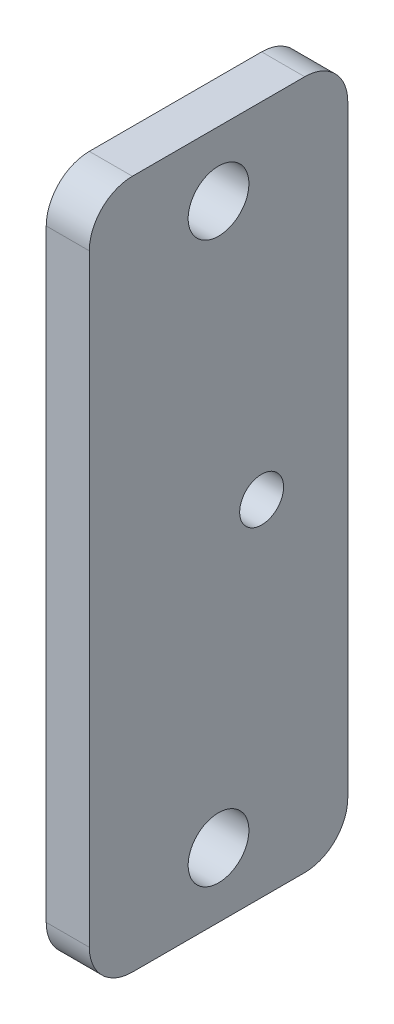
ISO-10303-21;
HEADER;
FILE_DESCRIPTION(('STEP AP214'),'2;1');
FILE_NAME('part.step','',(''),(''),'','','');
FILE_SCHEMA(('AUTOMOTIVE_DESIGN { 1 0 10303 214 1 1 1 1 }'));
ENDSEC;
DATA;
#1=APPLICATION_CONTEXT('core data for automotive mechanical design processes');
#2=APPLICATION_PROTOCOL_DEFINITION('international standard','automotive_design',2000,#1);
#3=PRODUCT_CONTEXT('',#1,'mechanical');
#4=PRODUCT('Part','Part','',(#3));
#5=PRODUCT_RELATED_PRODUCT_CATEGORY('part','',(#4));
#6=PRODUCT_DEFINITION_FORMATION('','',#4);
#7=PRODUCT_DEFINITION_CONTEXT('part definition',#1,'design');
#8=PRODUCT_DEFINITION('design','',#6,#7);
#9=PRODUCT_DEFINITION_SHAPE('','',#8);
#10=(LENGTH_UNIT() NAMED_UNIT(*) SI_UNIT(.MILLI.,.METRE.));
#11=(NAMED_UNIT(*) PLANE_ANGLE_UNIT() SI_UNIT($,.RADIAN.));
#12=(NAMED_UNIT(*) SI_UNIT($,.STERADIAN.) SOLID_ANGLE_UNIT());
#13=UNCERTAINTY_MEASURE_WITH_UNIT(LENGTH_MEASURE(1.E-05),#10,'distance_accuracy_value','');
#14=(GEOMETRIC_REPRESENTATION_CONTEXT(3) GLOBAL_UNCERTAINTY_ASSIGNED_CONTEXT((#13)) GLOBAL_UNIT_ASSIGNED_CONTEXT((#10,
#11,#12)) REPRESENTATION_CONTEXT('',''));
#15=CARTESIAN_POINT('',(0.,0.,0.));
#16=DIRECTION('',(0.,0.,1.));
#17=DIRECTION('',(1.,0.,0.));
#18=AXIS2_PLACEMENT_3D('',#15,#16,#17);
#19=CARTESIAN_POINT('',(-34.9999999999999,0.,-1.74860126378462E-13));
#20=DIRECTION('',(1.,0.,0.));
#21=DIRECTION('',(0.,0.,1.));
#22=AXIS2_PLACEMENT_3D('',#19,#20,#21);
#23=PLANE('',#22);
#24=CARTESIAN_POINT('',(-34.9999999999999,65.,-1.76697096577183E-13));
#25=DIRECTION('',(1.,0.,0.));
#26=DIRECTION('',(0.,0.,-1.));
#27=AXIS2_PLACEMENT_3D('',#24,#25,#26);
#28=CIRCLE('',#27,7.05);
#29=CARTESIAN_POINT('',(-34.9999999999999,65.,-7.05000000000018));
#30=VERTEX_POINT('',#29);
#31=EDGE_CURVE('E328',#30,#30,#28,.T.);
#32=ORIENTED_EDGE('',*,*,#31,.T.);
#33=EDGE_LOOP('',(#32));
#34=FACE_BOUND('',#33,.T.);
#35=CARTESIAN_POINT('',(-34.9999999999999,-65.,-1.78329573330415E-13));
#36=DIRECTION('',(1.,0.,0.));
#37=DIRECTION('',(0.,0.,-1.));
#38=AXIS2_PLACEMENT_3D('',#35,#36,#37);
#39=CIRCLE('',#38,7.05);
#40=CARTESIAN_POINT('',(-34.9999999999999,-65.,-7.05000000000018));
#41=VERTEX_POINT('',#40);
#42=EDGE_CURVE('E324',#41,#41,#39,.T.);
#43=ORIENTED_EDGE('',*,*,#42,.T.);
#44=EDGE_LOOP('',(#43));
#45=FACE_BOUND('',#44,.T.);
#46=DIRECTION('',(0.,-1.,0.));
#47=VECTOR('',#46,1.);
#48=CARTESIAN_POINT('',(-34.9999999999999,-80.0000000000001,29.9999999999998));
#49=LINE('',#48,#47);
#50=CARTESIAN_POINT('',(-34.9999999999999,70.,29.9999999999998));
#51=VERTEX_POINT('',#50);
#52=CARTESIAN_POINT('',(-34.9999999999999,-70.0000000000001,29.9999999999998));
#53=VERTEX_POINT('',#52);
#54=EDGE_CURVE('E106',#51,#53,#49,.T.);
#55=ORIENTED_EDGE('',*,*,#54,.F.);
#56=CARTESIAN_POINT('',(-34.9999999999999,70.,19.9999999999998));
#57=DIRECTION('',(-1.,0.,0.));
#58=DIRECTION('',(0.,0.,1.));
#59=AXIS2_PLACEMENT_3D('',#56,#57,#58);
#60=CIRCLE('',#59,10.);
#61=CARTESIAN_POINT('',(-34.9999999999999,80.,19.9999999999998));
#62=VERTEX_POINT('',#61);
#63=EDGE_CURVE('E113',#62,#51,#60,.F.);
#64=ORIENTED_EDGE('',*,*,#63,.F.);
#65=DIRECTION('',(0.,0.,1.));
#66=VECTOR('',#65,1.);
#67=CARTESIAN_POINT('',(-34.9999999999999,80.,-30.0000000000002));
#68=LINE('',#67,#66);
#69=CARTESIAN_POINT('',(-34.9999999999999,80.,-20.0000000000002));
#70=VERTEX_POINT('',#69);
#71=EDGE_CURVE('E126',#70,#62,#68,.T.);
#72=ORIENTED_EDGE('',*,*,#71,.F.);
#73=CARTESIAN_POINT('',(-34.9999999999999,70.,-20.0000000000002));
#74=DIRECTION('',(-1.,0.,0.));
#75=DIRECTION('',(0.,0.,1.));
#76=AXIS2_PLACEMENT_3D('',#73,#74,#75);
#77=CIRCLE('',#76,10.);
#78=CARTESIAN_POINT('',(-34.9999999999999,70.,-30.0000000000002));
#79=VERTEX_POINT('',#78);
#80=EDGE_CURVE('E118',#79,#70,#77,.F.);
#81=ORIENTED_EDGE('',*,*,#80,.F.);
#82=DIRECTION('',(0.,1.,0.));
#83=VECTOR('',#82,1.);
#84=CARTESIAN_POINT('',(-34.9999999999999,-80.,-30.0000000000002));
#85=LINE('',#84,#83);
#86=CARTESIAN_POINT('',(-34.9999999999999,-70.,-30.0000000000002));
#87=VERTEX_POINT('',#86);
#88=EDGE_CURVE('E130',#87,#79,#85,.T.);
#89=ORIENTED_EDGE('',*,*,#88,.F.);
#90=CARTESIAN_POINT('',(-34.9999999999999,-70.,-20.0000000000002));
#91=DIRECTION('',(-1.,0.,0.));
#92=DIRECTION('',(0.,0.,1.));
#93=AXIS2_PLACEMENT_3D('',#90,#91,#92);
#94=CIRCLE('',#93,10.);
#95=CARTESIAN_POINT('',(-34.9999999999999,-80.,-20.0000000000002));
#96=VERTEX_POINT('',#95);
#97=EDGE_CURVE('E137',#96,#87,#94,.F.);
#98=ORIENTED_EDGE('',*,*,#97,.F.);
#99=DIRECTION('',(0.,0.,-1.));
#100=VECTOR('',#99,1.);
#101=CARTESIAN_POINT('',(-34.9999999999999,-80.,-30.0000000000002));
#102=LINE('',#101,#100);
#103=CARTESIAN_POINT('',(-34.9999999999999,-80.0000000000001,19.9999999999998));
#104=VERTEX_POINT('',#103);
#105=EDGE_CURVE('E171',#104,#96,#102,.T.);
#106=ORIENTED_EDGE('',*,*,#105,.F.);
#107=CARTESIAN_POINT('',(-34.9999999999999,-70.0000000000001,19.9999999999998));
#108=DIRECTION('',(-1.,0.,0.));
#109=DIRECTION('',(0.,0.,1.));
#110=AXIS2_PLACEMENT_3D('',#107,#108,#109);
#111=CIRCLE('',#110,10.);
#112=EDGE_CURVE('E124',#53,#104,#111,.F.);
#113=ORIENTED_EDGE('',*,*,#112,.F.);
#114=EDGE_LOOP('',(#55,#64,#72,#81,#89,#98,#106,#113));
#115=FACE_BOUND('',#114,.T.);
#116=CARTESIAN_POINT('',(-34.9999999999999,0.,-10.));
#117=DIRECTION('',(1.,0.,0.));
#118=DIRECTION('',(0.,0.,-1.));
#119=AXIS2_PLACEMENT_3D('',#116,#117,#118);
#120=CIRCLE('',#119,5.1);
#121=CARTESIAN_POINT('',(-34.9999999999999,0.,-15.1));
#122=VERTEX_POINT('',#121);
#123=EDGE_CURVE('E333',#122,#122,#120,.T.);
#124=ORIENTED_EDGE('',*,*,#123,.T.);
#125=EDGE_LOOP('',(#124));
#126=FACE_BOUND('',#125,.T.);
#127=ADVANCED_FACE('F36',(#34,#45,#115,#126),#23,.F.);
#128=CARTESIAN_POINT('',(-24.9999999999999,-80.,-30.0000000000002));
#129=DIRECTION('',(0.,-1.,0.));
#130=DIRECTION('',(0.,0.,-1.));
#131=AXIS2_PLACEMENT_3D('',#128,#129,#130);
#132=PLANE('',#131);
#133=ORIENTED_EDGE('',*,*,#105,.T.);
#134=DIRECTION('',(-1.,0.,0.));
#135=VECTOR('',#134,1.);
#136=CARTESIAN_POINT('',(-24.9999999999999,-80.,-20.0000000000002));
#137=LINE('',#136,#135);
#138=CARTESIAN_POINT('',(-24.9999999999999,-80.,-20.0000000000002));
#139=VERTEX_POINT('',#138);
#140=EDGE_CURVE('E141',#139,#96,#137,.T.);
#141=ORIENTED_EDGE('',*,*,#140,.F.);
#142=DIRECTION('',(0.,0.,-1.));
#143=VECTOR('',#142,1.);
#144=CARTESIAN_POINT('',(-24.9999999999999,-80.,-30.0000000000002));
#145=LINE('',#144,#143);
#146=CARTESIAN_POINT('',(-24.9999999999999,-80.0000000000001,19.9999999999998));
#147=VERTEX_POINT('',#146);
#148=EDGE_CURVE('E125',#147,#139,#145,.T.);
#149=ORIENTED_EDGE('',*,*,#148,.F.);
#150=DIRECTION('',(-1.,0.,0.));
#151=VECTOR('',#150,1.);
#152=CARTESIAN_POINT('',(-24.9999999999999,-80.0000000000001,19.9999999999998));
#153=LINE('',#152,#151);
#154=EDGE_CURVE('E143',#104,#147,#153,.F.);
#155=ORIENTED_EDGE('',*,*,#154,.F.);
#156=EDGE_LOOP('',(#133,#141,#149,#155));
#157=FACE_BOUND('',#156,.T.);
#158=ADVANCED_FACE('F185',(#157),#132,.T.);
#159=CARTESIAN_POINT('',(-24.9999999999999,-80.0000000000001,29.9999999999998));
#160=DIRECTION('',(0.,0.,1.));
#161=DIRECTION('',(-1.,0.,0.));
#162=AXIS2_PLACEMENT_3D('',#159,#160,#161);
#163=PLANE('',#162);
#164=DIRECTION('',(0.,-1.,0.));
#165=VECTOR('',#164,1.);
#166=CARTESIAN_POINT('',(-24.9999999999999,-80.0000000000001,29.9999999999998));
#167=LINE('',#166,#165);
#168=CARTESIAN_POINT('',(-24.9999999999999,70.,29.9999999999998));
#169=VERTEX_POINT('',#168);
#170=CARTESIAN_POINT('',(-24.9999999999999,-70.0000000000001,29.9999999999998));
#171=VERTEX_POINT('',#170);
#172=EDGE_CURVE('E108',#169,#171,#167,.T.);
#173=ORIENTED_EDGE('',*,*,#172,.F.);
#174=DIRECTION('',(-1.,0.,0.));
#175=VECTOR('',#174,1.);
#176=CARTESIAN_POINT('',(-24.9999999999999,70.,29.9999999999998));
#177=LINE('',#176,#175);
#178=EDGE_CURVE('E101',#51,#169,#177,.F.);
#179=ORIENTED_EDGE('',*,*,#178,.F.);
#180=ORIENTED_EDGE('',*,*,#54,.T.);
#181=DIRECTION('',(-1.,0.,0.));
#182=VECTOR('',#181,1.);
#183=CARTESIAN_POINT('',(-24.9999999999999,-70.0000000000001,29.9999999999998));
#184=LINE('',#183,#182);
#185=EDGE_CURVE('E110',#171,#53,#184,.T.);
#186=ORIENTED_EDGE('',*,*,#185,.F.);
#187=EDGE_LOOP('',(#173,#179,#180,#186));
#188=FACE_BOUND('',#187,.T.);
#189=ADVANCED_FACE('F103',(#188),#163,.T.);
#190=CARTESIAN_POINT('',(-24.9999999999999,80.,-30.0000000000002));
#191=DIRECTION('',(0.,1.,0.));
#192=DIRECTION('',(0.,0.,1.));
#193=AXIS2_PLACEMENT_3D('',#190,#191,#192);
#194=PLANE('',#193);
#195=ORIENTED_EDGE('',*,*,#71,.T.);
#196=DIRECTION('',(-1.,0.,0.));
#197=VECTOR('',#196,1.);
#198=CARTESIAN_POINT('',(-24.9999999999999,80.,19.9999999999998));
#199=LINE('',#198,#197);
#200=CARTESIAN_POINT('',(-24.9999999999999,80.,19.9999999999998));
#201=VERTEX_POINT('',#200);
#202=EDGE_CURVE('E44',#201,#62,#199,.T.);
#203=ORIENTED_EDGE('',*,*,#202,.F.);
#204=DIRECTION('',(0.,0.,1.));
#205=VECTOR('',#204,1.);
#206=CARTESIAN_POINT('',(-24.9999999999999,80.,-30.0000000000002));
#207=LINE('',#206,#205);
#208=CARTESIAN_POINT('',(-24.9999999999999,80.,-20.0000000000002));
#209=VERTEX_POINT('',#208);
#210=EDGE_CURVE('E164',#209,#201,#207,.T.);
#211=ORIENTED_EDGE('',*,*,#210,.F.);
#212=DIRECTION('',(-1.,0.,0.));
#213=VECTOR('',#212,1.);
#214=CARTESIAN_POINT('',(-24.9999999999999,80.,-20.0000000000002));
#215=LINE('',#214,#213);
#216=EDGE_CURVE('E11',#70,#209,#215,.F.);
#217=ORIENTED_EDGE('',*,*,#216,.F.);
#218=EDGE_LOOP('',(#195,#203,#211,#217));
#219=FACE_BOUND('',#218,.T.);
#220=ADVANCED_FACE('F178',(#219),#194,.T.);
#221=CARTESIAN_POINT('',(-24.9999999999999,-80.,-30.0000000000002));
#222=DIRECTION('',(0.,0.,-1.));
#223=DIRECTION('',(1.,0.,0.));
#224=AXIS2_PLACEMENT_3D('',#221,#222,#223);
#225=PLANE('',#224);
#226=ORIENTED_EDGE('',*,*,#88,.T.);
#227=DIRECTION('',(-1.,0.,0.));
#228=VECTOR('',#227,1.);
#229=CARTESIAN_POINT('',(-24.9999999999999,70.,-30.0000000000002));
#230=LINE('',#229,#228);
#231=CARTESIAN_POINT('',(-24.9999999999999,70.,-30.0000000000002));
#232=VERTEX_POINT('',#231);
#233=EDGE_CURVE('E152',#232,#79,#230,.T.);
#234=ORIENTED_EDGE('',*,*,#233,.F.);
#235=DIRECTION('',(0.,1.,0.));
#236=VECTOR('',#235,1.);
#237=CARTESIAN_POINT('',(-24.9999999999999,-80.,-30.0000000000002));
#238=LINE('',#237,#236);
#239=CARTESIAN_POINT('',(-24.9999999999999,-70.,-30.0000000000002));
#240=VERTEX_POINT('',#239);
#241=EDGE_CURVE('E128',#240,#232,#238,.T.);
#242=ORIENTED_EDGE('',*,*,#241,.F.);
#243=DIRECTION('',(-1.,0.,0.));
#244=VECTOR('',#243,1.);
#245=CARTESIAN_POINT('',(-24.9999999999999,-70.,-30.0000000000002));
#246=LINE('',#245,#244);
#247=EDGE_CURVE('E154',#87,#240,#246,.F.);
#248=ORIENTED_EDGE('',*,*,#247,.F.);
#249=EDGE_LOOP('',(#226,#234,#242,#248));
#250=FACE_BOUND('',#249,.T.);
#251=ADVANCED_FACE('F163',(#250),#225,.T.);
#252=CARTESIAN_POINT('',(-24.9999999999999,0.,-1.74860126378462E-13));
#253=DIRECTION('',(1.,0.,0.));
#254=DIRECTION('',(0.,0.,1.));
#255=AXIS2_PLACEMENT_3D('',#252,#253,#254);
#256=PLANE('',#255);
#257=CARTESIAN_POINT('',(-24.9999999999999,0.,-10.));
#258=DIRECTION('',(-1.,0.,0.));
#259=DIRECTION('',(0.,0.,1.));
#260=AXIS2_PLACEMENT_3D('',#257,#258,#259);
#261=CIRCLE('',#260,5.09999999999999);
#262=CARTESIAN_POINT('',(-24.9999999999999,0.,-4.90000000000002));
#263=VERTEX_POINT('',#262);
#264=EDGE_CURVE('E317',#263,#263,#261,.T.);
#265=ORIENTED_EDGE('',*,*,#264,.T.);
#266=EDGE_LOOP('',(#265));
#267=FACE_BOUND('',#266,.T.);
#268=CARTESIAN_POINT('',(-24.9999999999999,65.,-1.76697096577183E-13));
#269=DIRECTION('',(1.,0.,0.));
#270=DIRECTION('',(0.,0.,-1.));
#271=AXIS2_PLACEMENT_3D('',#268,#269,#270);
#272=CIRCLE('',#271,7.05);
#273=CARTESIAN_POINT('',(-24.9999999999999,65.,-7.05000000000018));
#274=VERTEX_POINT('',#273);
#275=EDGE_CURVE('E321',#274,#274,#272,.T.);
#276=ORIENTED_EDGE('',*,*,#275,.F.);
#277=EDGE_LOOP('',(#276));
#278=FACE_BOUND('',#277,.T.);
#279=CARTESIAN_POINT('',(-24.9999999999999,-65.,-1.78329573330415E-13));
#280=DIRECTION('',(1.,0.,0.));
#281=DIRECTION('',(0.,0.,-1.));
#282=AXIS2_PLACEMENT_3D('',#279,#280,#281);
#283=CIRCLE('',#282,7.05);
#284=CARTESIAN_POINT('',(-24.9999999999999,-65.,-7.05000000000018));
#285=VERTEX_POINT('',#284);
#286=EDGE_CURVE('E173',#285,#285,#283,.T.);
#287=ORIENTED_EDGE('',*,*,#286,.F.);
#288=EDGE_LOOP('',(#287));
#289=FACE_BOUND('',#288,.T.);
#290=ORIENTED_EDGE('',*,*,#148,.T.);
#291=CARTESIAN_POINT('',(-24.9999999999999,-70.,-20.0000000000002));
#292=DIRECTION('',(-1.,0.,0.));
#293=DIRECTION('',(0.,0.,1.));
#294=AXIS2_PLACEMENT_3D('',#291,#292,#293);
#295=CIRCLE('',#294,10.);
#296=EDGE_CURVE('E57',#240,#139,#295,.T.);
#297=ORIENTED_EDGE('',*,*,#296,.F.);
#298=ORIENTED_EDGE('',*,*,#241,.T.);
#299=CARTESIAN_POINT('',(-24.9999999999999,70.,-20.0000000000002));
#300=DIRECTION('',(-1.,0.,0.));
#301=DIRECTION('',(0.,0.,1.));
#302=AXIS2_PLACEMENT_3D('',#299,#300,#301);
#303=CIRCLE('',#302,10.);
#304=EDGE_CURVE('E50',#209,#232,#303,.T.);
#305=ORIENTED_EDGE('',*,*,#304,.F.);
#306=ORIENTED_EDGE('',*,*,#210,.T.);
#307=CARTESIAN_POINT('',(-24.9999999999999,70.,19.9999999999998));
#308=DIRECTION('',(-1.,0.,0.));
#309=DIRECTION('',(0.,0.,1.));
#310=AXIS2_PLACEMENT_3D('',#307,#308,#309);
#311=CIRCLE('',#310,10.);
#312=EDGE_CURVE('E146',#169,#201,#311,.T.);
#313=ORIENTED_EDGE('',*,*,#312,.F.);
#314=ORIENTED_EDGE('',*,*,#172,.T.);
#315=CARTESIAN_POINT('',(-24.9999999999999,-70.0000000000001,19.9999999999998));
#316=DIRECTION('',(-1.,0.,0.));
#317=DIRECTION('',(0.,0.,1.));
#318=AXIS2_PLACEMENT_3D('',#315,#316,#317);
#319=CIRCLE('',#318,10.);
#320=EDGE_CURVE('E150',#147,#171,#319,.T.);
#321=ORIENTED_EDGE('',*,*,#320,.F.);
#322=EDGE_LOOP('',(#290,#297,#298,#305,#306,#313,#314,#321));
#323=FACE_BOUND('',#322,.T.);
#324=ADVANCED_FACE('F179',(#267,#278,#289,#323),#256,.T.);
#325=CARTESIAN_POINT('',(-24.9999999999999,-65.,-1.78329573330415E-13));
#326=DIRECTION('',(-1.,0.,0.));
#327=DIRECTION('',(0.,0.,-1.));
#328=AXIS2_PLACEMENT_3D('',#325,#326,#327);
#329=CYLINDRICAL_SURFACE('',#328,7.05);
#330=ORIENTED_EDGE('',*,*,#286,.T.);
#331=EDGE_LOOP('',(#330));
#332=FACE_BOUND('',#331,.T.);
#333=ORIENTED_EDGE('',*,*,#42,.F.);
#334=EDGE_LOOP('',(#333));
#335=FACE_BOUND('',#334,.T.);
#336=ADVANCED_FACE('F219',(#332,#335),#329,.F.);
#337=CARTESIAN_POINT('',(-24.9999999999999,65.,-1.76697096577183E-13));
#338=DIRECTION('',(-1.,0.,0.));
#339=DIRECTION('',(0.,0.,-1.));
#340=AXIS2_PLACEMENT_3D('',#337,#338,#339);
#341=CYLINDRICAL_SURFACE('',#340,7.05);
#342=ORIENTED_EDGE('',*,*,#275,.T.);
#343=EDGE_LOOP('',(#342));
#344=FACE_BOUND('',#343,.T.);
#345=ORIENTED_EDGE('',*,*,#31,.F.);
#346=EDGE_LOOP('',(#345));
#347=FACE_BOUND('',#346,.T.);
#348=ADVANCED_FACE('F200',(#344,#347),#341,.F.);
#349=CARTESIAN_POINT('',(-24.9999999999999,-70.0000000000001,19.9999999999998));
#350=DIRECTION('',(-1.,0.,0.));
#351=DIRECTION('',(0.,0.,-1.));
#352=AXIS2_PLACEMENT_3D('',#349,#350,#351);
#353=CYLINDRICAL_SURFACE('',#352,10.);
#354=ORIENTED_EDGE('',*,*,#320,.T.);
#355=ORIENTED_EDGE('',*,*,#185,.T.);
#356=ORIENTED_EDGE('',*,*,#112,.T.);
#357=ORIENTED_EDGE('',*,*,#154,.T.);
#358=EDGE_LOOP('',(#354,#355,#356,#357));
#359=FACE_BOUND('',#358,.T.);
#360=ADVANCED_FACE('F183',(#359),#353,.T.);
#361=CARTESIAN_POINT('',(-24.9999999999999,-70.,-20.0000000000002));
#362=DIRECTION('',(-1.,0.,0.));
#363=DIRECTION('',(0.,0.,-1.));
#364=AXIS2_PLACEMENT_3D('',#361,#362,#363);
#365=CYLINDRICAL_SURFACE('',#364,10.);
#366=ORIENTED_EDGE('',*,*,#296,.T.);
#367=ORIENTED_EDGE('',*,*,#140,.T.);
#368=ORIENTED_EDGE('',*,*,#97,.T.);
#369=ORIENTED_EDGE('',*,*,#247,.T.);
#370=EDGE_LOOP('',(#366,#367,#368,#369));
#371=FACE_BOUND('',#370,.T.);
#372=ADVANCED_FACE('F157',(#371),#365,.T.);
#373=CARTESIAN_POINT('',(-24.9999999999999,70.,-20.0000000000002));
#374=DIRECTION('',(-1.,0.,0.));
#375=DIRECTION('',(0.,0.,-1.));
#376=AXIS2_PLACEMENT_3D('',#373,#374,#375);
#377=CYLINDRICAL_SURFACE('',#376,10.);
#378=ORIENTED_EDGE('',*,*,#304,.T.);
#379=ORIENTED_EDGE('',*,*,#233,.T.);
#380=ORIENTED_EDGE('',*,*,#80,.T.);
#381=ORIENTED_EDGE('',*,*,#216,.T.);
#382=EDGE_LOOP('',(#378,#379,#380,#381));
#383=FACE_BOUND('',#382,.T.);
#384=ADVANCED_FACE('F175',(#383),#377,.T.);
#385=CARTESIAN_POINT('',(-24.9999999999999,70.,19.9999999999998));
#386=DIRECTION('',(-1.,0.,0.));
#387=DIRECTION('',(0.,0.,-1.));
#388=AXIS2_PLACEMENT_3D('',#385,#386,#387);
#389=CYLINDRICAL_SURFACE('',#388,10.);
#390=ORIENTED_EDGE('',*,*,#312,.T.);
#391=ORIENTED_EDGE('',*,*,#202,.T.);
#392=ORIENTED_EDGE('',*,*,#63,.T.);
#393=ORIENTED_EDGE('',*,*,#178,.T.);
#394=EDGE_LOOP('',(#390,#391,#392,#393));
#395=FACE_BOUND('',#394,.T.);
#396=ADVANCED_FACE('F38',(#395),#389,.T.);
#397=CARTESIAN_POINT('',(-34.9999999999999,0.,-10.));
#398=DIRECTION('',(-1.,0.,0.));
#399=DIRECTION('',(0.,0.,-1.));
#400=AXIS2_PLACEMENT_3D('',#397,#398,#399);
#401=CYLINDRICAL_SURFACE('',#400,5.09999999999999);
#402=ORIENTED_EDGE('',*,*,#123,.F.);
#403=EDGE_LOOP('',(#402));
#404=FACE_BOUND('',#403,.T.);
#405=ORIENTED_EDGE('',*,*,#264,.F.);
#406=EDGE_LOOP('',(#405));
#407=FACE_BOUND('',#406,.T.);
#408=ADVANCED_FACE('F206',(#404,#407),#401,.F.);
#409=CLOSED_SHELL('',(#127,#158,#189,#220,#251,#324,#336,#348,#360,#372,#384,#396,#408));
#410=MANIFOLD_SOLID_BREP('B2',#409);
#411=ADVANCED_BREP_SHAPE_REPRESENTATION('',(#18,#410),#14);
#412=SHAPE_DEFINITION_REPRESENTATION(#9,#411);
ENDSEC;
END-ISO-10303-21;
